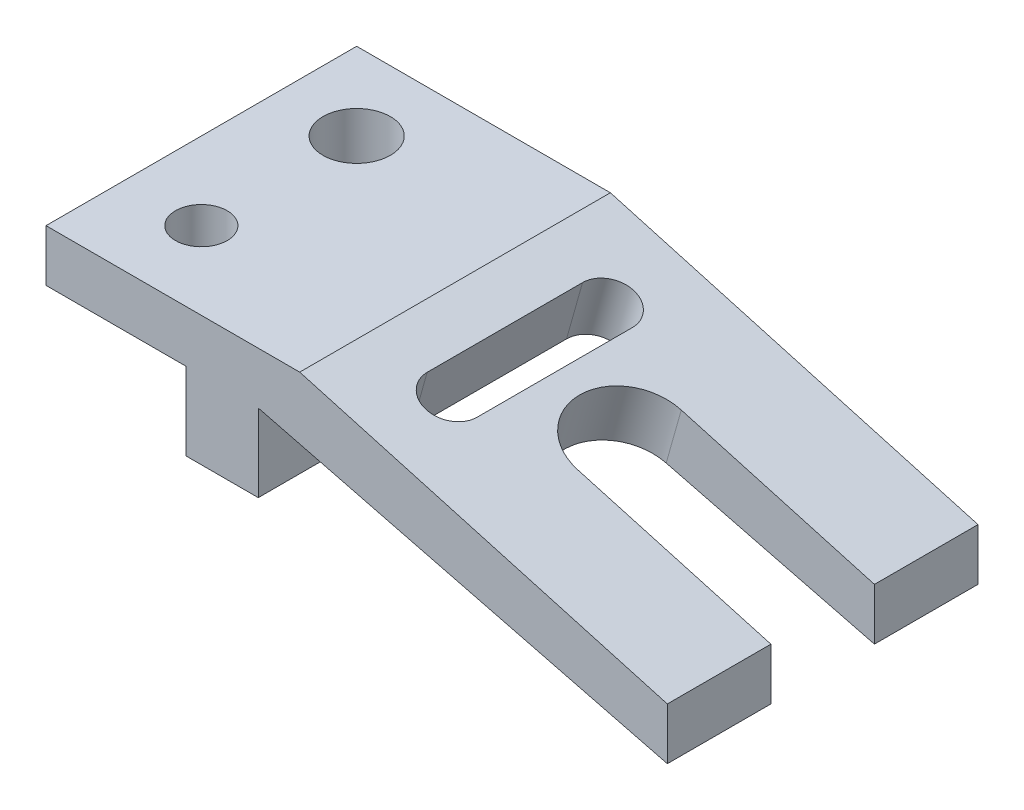
ISO-10303-21;
HEADER;
FILE_DESCRIPTION(('STEP AP214'),'2;1');
FILE_NAME('part.step','',(''),(''),'','','');
FILE_SCHEMA(('AUTOMOTIVE_DESIGN { 1 0 10303 214 1 1 1 1 }'));
ENDSEC;
DATA;
#1=APPLICATION_CONTEXT('core data for automotive mechanical design processes');
#2=APPLICATION_PROTOCOL_DEFINITION('international standard','automotive_design',2000,#1);
#3=PRODUCT_CONTEXT('',#1,'mechanical');
#4=PRODUCT('Part','Part','',(#3));
#5=PRODUCT_RELATED_PRODUCT_CATEGORY('part','',(#4));
#6=PRODUCT_DEFINITION_FORMATION('','',#4);
#7=PRODUCT_DEFINITION_CONTEXT('part definition',#1,'design');
#8=PRODUCT_DEFINITION('design','',#6,#7);
#9=PRODUCT_DEFINITION_SHAPE('','',#8);
#10=(LENGTH_UNIT() NAMED_UNIT(*) SI_UNIT(.MILLI.,.METRE.));
#11=(NAMED_UNIT(*) PLANE_ANGLE_UNIT() SI_UNIT($,.RADIAN.));
#12=(NAMED_UNIT(*) SI_UNIT($,.STERADIAN.) SOLID_ANGLE_UNIT());
#13=UNCERTAINTY_MEASURE_WITH_UNIT(LENGTH_MEASURE(1.E-05),#10,'distance_accuracy_value','');
#14=(GEOMETRIC_REPRESENTATION_CONTEXT(3) GLOBAL_UNCERTAINTY_ASSIGNED_CONTEXT((#13)) GLOBAL_UNIT_ASSIGNED_CONTEXT((#10,
#11,#12)) REPRESENTATION_CONTEXT('',''));
#15=CARTESIAN_POINT('',(0.,0.,0.));
#16=DIRECTION('',(0.,0.,1.));
#17=DIRECTION('',(1.,0.,0.));
#18=AXIS2_PLACEMENT_3D('',#15,#16,#17);
#19=CARTESIAN_POINT('',(79.343143812709,2.44230769230769,76.2));
#20=DIRECTION('',(-1.,0.,0.));
#21=DIRECTION('',(0.,0.,1.));
#22=AXIS2_PLACEMENT_3D('',#19,#20,#21);
#23=PLANE('',#22);
#24=DIRECTION('',(0.,1.,0.));
#25=VECTOR('',#24,1.);
#26=CARTESIAN_POINT('',(79.343143812709,2.44230769230769,25.4));
#27=LINE('',#26,#25);
#28=CARTESIAN_POINT('',(79.3431438127091,-35.6576923076923,25.4));
#29=VERTEX_POINT('',#28);
#30=CARTESIAN_POINT('',(79.343143812709,-22.9576923076923,25.4));
#31=VERTEX_POINT('',#30);
#32=EDGE_CURVE('E103',#29,#31,#27,.T.);
#33=ORIENTED_EDGE('',*,*,#32,.F.);
#34=DIRECTION('',(0.,0.,-1.));
#35=VECTOR('',#34,1.);
#36=CARTESIAN_POINT('',(79.343143812709,-35.6576923076923,76.2));
#37=LINE('',#36,#35);
#38=CARTESIAN_POINT('',(79.343143812709,-35.6576923076923,0.));
#39=VERTEX_POINT('',#38);
#40=EDGE_CURVE('E229',#29,#39,#37,.T.);
#41=ORIENTED_EDGE('',*,*,#40,.T.);
#42=DIRECTION('',(0.,1.,0.));
#43=VECTOR('',#42,1.);
#44=CARTESIAN_POINT('',(79.343143812709,2.44230769230769,0.));
#45=LINE('',#44,#43);
#46=CARTESIAN_POINT('',(79.343143812709,-22.9576923076923,0.));
#47=VERTEX_POINT('',#46);
#48=EDGE_CURVE('E367',#39,#47,#45,.T.);
#49=ORIENTED_EDGE('',*,*,#48,.T.);
#50=DIRECTION('',(0.,0.,1.));
#51=VECTOR('',#50,1.);
#52=CARTESIAN_POINT('',(79.343143812709,-22.9576923076923,0.));
#53=LINE('',#52,#51);
#54=EDGE_CURVE('E289',#47,#31,#53,.T.);
#55=ORIENTED_EDGE('',*,*,#54,.T.);
#56=EDGE_LOOP('',(#33,#41,#49,#55));
#57=FACE_BOUND('',#56,.T.);
#58=ADVANCED_FACE('F87',(#57),#23,.F.);
#59=CARTESIAN_POINT('',(-73.056856187291,2.44230769230769,76.2));
#60=DIRECTION('',(1.,0.,0.));
#61=DIRECTION('',(0.,0.,-1.));
#62=AXIS2_PLACEMENT_3D('',#59,#60,#61);
#63=PLANE('',#62);
#64=DIRECTION('',(0.,-1.,0.));
#65=VECTOR('',#64,1.);
#66=CARTESIAN_POINT('',(-73.056856187291,2.44230769230769,0.));
#67=LINE('',#66,#65);
#68=CARTESIAN_POINT('',(-73.056856187291,2.44230769230769,0.));
#69=VERTEX_POINT('',#68);
#70=CARTESIAN_POINT('',(-73.056856187291,-10.2576923076923,0.));
#71=VERTEX_POINT('',#70);
#72=EDGE_CURVE('E347',#69,#71,#67,.T.);
#73=ORIENTED_EDGE('',*,*,#72,.T.);
#74=DIRECTION('',(0.,0.,1.));
#75=VECTOR('',#74,1.);
#76=CARTESIAN_POINT('',(-73.056856187291,-10.2576923076923,0.));
#77=LINE('',#76,#75);
#78=CARTESIAN_POINT('',(-73.056856187291,-10.2576923076923,76.2));
#79=VERTEX_POINT('',#78);
#80=EDGE_CURVE('E343',#71,#79,#77,.T.);
#81=ORIENTED_EDGE('',*,*,#80,.T.);
#82=DIRECTION('',(0.,-1.,0.));
#83=VECTOR('',#82,1.);
#84=CARTESIAN_POINT('',(-73.056856187291,2.44230769230769,76.2));
#85=LINE('',#84,#83);
#86=CARTESIAN_POINT('',(-73.056856187291,2.44230769230769,76.2));
#87=VERTEX_POINT('',#86);
#88=EDGE_CURVE('E351',#87,#79,#85,.T.);
#89=ORIENTED_EDGE('',*,*,#88,.F.);
#90=DIRECTION('',(0.,0.,-1.));
#91=VECTOR('',#90,1.);
#92=CARTESIAN_POINT('',(-73.056856187291,2.44230769230769,76.2));
#93=LINE('',#92,#91);
#94=EDGE_CURVE('E363',#87,#69,#93,.T.);
#95=ORIENTED_EDGE('',*,*,#94,.T.);
#96=EDGE_LOOP('',(#73,#81,#89,#95));
#97=FACE_BOUND('',#96,.T.);
#98=ADVANCED_FACE('F89',(#97),#63,.F.);
#99=CARTESIAN_POINT('',(79.343143812709,-35.6576923076923,76.2));
#100=VERTEX_POINT('',#99);
#101=CARTESIAN_POINT('',(79.3431438127091,-35.6576923076923,50.8));
#102=VERTEX_POINT('',#101);
#103=EDGE_CURVE('E376',#100,#102,#37,.T.);
#104=ORIENTED_EDGE('',*,*,#103,.T.);
#105=DIRECTION('',(0.,1.,0.));
#106=VECTOR('',#105,1.);
#107=CARTESIAN_POINT('',(79.343143812709,2.44230769230769,50.8));
#108=LINE('',#107,#106);
#109=CARTESIAN_POINT('',(79.343143812709,-22.9576923076923,50.8));
#110=VERTEX_POINT('',#109);
#111=EDGE_CURVE('E219',#102,#110,#108,.T.);
#112=ORIENTED_EDGE('',*,*,#111,.T.);
#113=CARTESIAN_POINT('',(79.343143812709,-22.9576923076923,76.2));
#114=VERTEX_POINT('',#113);
#115=EDGE_CURVE('E294',#110,#114,#53,.T.);
#116=ORIENTED_EDGE('',*,*,#115,.T.);
#117=DIRECTION('',(0.,1.,0.));
#118=VECTOR('',#117,1.);
#119=CARTESIAN_POINT('',(79.343143812709,2.44230769230769,76.2));
#120=LINE('',#119,#118);
#121=EDGE_CURVE('E355',#100,#114,#120,.T.);
#122=ORIENTED_EDGE('',*,*,#121,.F.);
#123=EDGE_LOOP('',(#104,#112,#116,#122));
#124=FACE_BOUND('',#123,.T.);
#125=ADVANCED_FACE('F418',(#124),#23,.F.);
#126=CARTESIAN_POINT('',(-73.056856187291,2.44230769230769,76.2));
#127=DIRECTION('',(0.,-1.,0.));
#128=DIRECTION('',(0.,0.,-1.));
#129=AXIS2_PLACEMENT_3D('',#126,#127,#128);
#130=PLANE('',#129);
#131=CARTESIAN_POINT('',(-54.006856187291,2.44230769230769,19.05));
#132=DIRECTION('',(0.,-1.,0.));
#133=DIRECTION('',(0.,0.,-1.));
#134=AXIS2_PLACEMENT_3D('',#131,#132,#133);
#135=CIRCLE('',#134,8.255);
#136=CARTESIAN_POINT('',(-54.006856187291,2.44230769230769,27.305));
#137=VERTEX_POINT('',#136);
#138=EDGE_CURVE('E271',#137,#137,#135,.T.);
#139=ORIENTED_EDGE('',*,*,#138,.T.);
#140=EDGE_LOOP('',(#139));
#141=FACE_BOUND('',#140,.T.);
#142=CARTESIAN_POINT('',(-54.006856187291,2.44230769230769,57.15));
#143=DIRECTION('',(0.,1.,0.));
#144=DIRECTION('',(0.,0.,1.));
#145=AXIS2_PLACEMENT_3D('',#142,#143,#144);
#146=CIRCLE('',#145,6.35);
#147=CARTESIAN_POINT('',(-54.006856187291,2.44230769230769,63.5));
#148=VERTEX_POINT('',#147);
#149=EDGE_CURVE('E275',#148,#148,#146,.T.);
#150=ORIENTED_EDGE('',*,*,#149,.F.);
#151=EDGE_LOOP('',(#150));
#152=FACE_BOUND('',#151,.T.);
#153=DIRECTION('',(-1.,0.,0.));
#154=VECTOR('',#153,1.);
#155=CARTESIAN_POINT('',(-73.056856187291,2.44230769230769,76.2));
#156=LINE('',#155,#154);
#157=CARTESIAN_POINT('',(-10.826856187291,2.44230769230769,76.2));
#158=VERTEX_POINT('',#157);
#159=EDGE_CURVE('E360',#158,#87,#156,.T.);
#160=ORIENTED_EDGE('',*,*,#159,.F.);
#161=DIRECTION('',(0.,0.,1.));
#162=VECTOR('',#161,1.);
#163=CARTESIAN_POINT('',(-10.826856187291,2.44230769230769,0.));
#164=LINE('',#163,#162);
#165=CARTESIAN_POINT('',(-10.826856187291,2.44230769230769,0.));
#166=VERTEX_POINT('',#165);
#167=EDGE_CURVE('E284',#166,#158,#164,.T.);
#168=ORIENTED_EDGE('',*,*,#167,.F.);
#169=DIRECTION('',(-1.,0.,0.));
#170=VECTOR('',#169,1.);
#171=CARTESIAN_POINT('',(-73.056856187291,2.44230769230769,0.));
#172=LINE('',#171,#170);
#173=EDGE_CURVE('E356',#166,#69,#172,.T.);
#174=ORIENTED_EDGE('',*,*,#173,.T.);
#175=ORIENTED_EDGE('',*,*,#94,.F.);
#176=EDGE_LOOP('',(#160,#168,#174,#175));
#177=FACE_BOUND('',#176,.T.);
#178=ADVANCED_FACE('F487',(#141,#152,#177),#130,.F.);
#179=CARTESIAN_POINT('',(0.,0.,76.2));
#180=DIRECTION('',(0.,0.,1.));
#181=DIRECTION('',(1.,0.,0.));
#182=AXIS2_PLACEMENT_3D('',#179,#180,#181);
#183=PLANE('',#182);
#184=DIRECTION('',(0.962540441844964,-0.271138152632384,0.));
#185=VECTOR('',#184,1.);
#186=CARTESIAN_POINT('',(79.343143812709,-22.9576923076923,76.2));
#187=LINE('',#186,#185);
#188=EDGE_CURVE('E285',#158,#114,#187,.T.);
#189=ORIENTED_EDGE('',*,*,#188,.F.);
#190=ORIENTED_EDGE('',*,*,#159,.T.);
#191=ORIENTED_EDGE('',*,*,#88,.T.);
#192=DIRECTION('',(-1.,0.,0.));
#193=VECTOR('',#192,1.);
#194=CARTESIAN_POINT('',(-73.056856187291,-10.2576923076923,76.2));
#195=LINE('',#194,#193);
#196=CARTESIAN_POINT('',(-38.766856187291,-10.2576923076923,76.2));
#197=VERTEX_POINT('',#196);
#198=EDGE_CURVE('E334',#197,#79,#195,.T.);
#199=ORIENTED_EDGE('',*,*,#198,.F.);
#200=DIRECTION('',(0.,1.,0.));
#201=VECTOR('',#200,1.);
#202=CARTESIAN_POINT('',(-38.766856187291,-35.6576923076923,76.2));
#203=LINE('',#202,#201);
#204=CARTESIAN_POINT('',(-38.766856187291,-29.3076923076923,76.2));
#205=VERTEX_POINT('',#204);
#206=EDGE_CURVE('E326',#205,#197,#203,.T.);
#207=ORIENTED_EDGE('',*,*,#206,.F.);
#208=DIRECTION('',(-1.,0.,0.));
#209=VECTOR('',#208,1.);
#210=CARTESIAN_POINT('',(-38.766856187291,-29.3076923076923,76.2));
#211=LINE('',#210,#209);
#212=CARTESIAN_POINT('',(-20.986856187291,-29.3076923076923,76.2));
#213=VERTEX_POINT('',#212);
#214=EDGE_CURVE('E314',#213,#205,#211,.T.);
#215=ORIENTED_EDGE('',*,*,#214,.F.);
#216=DIRECTION('',(0.,-1.,0.));
#217=VECTOR('',#216,1.);
#218=CARTESIAN_POINT('',(-20.986856187291,-35.6576923076923,76.2));
#219=LINE('',#218,#217);
#220=CARTESIAN_POINT('',(-20.986856187291,-10.2576923076923,76.2));
#221=VERTEX_POINT('',#220);
#222=EDGE_CURVE('E302',#221,#213,#219,.T.);
#223=ORIENTED_EDGE('',*,*,#222,.F.);
#224=DIRECTION('',(-0.969416374533033,0.245421866970388,0.));
#225=VECTOR('',#224,1.);
#226=CARTESIAN_POINT('',(-20.986856187291,-10.2576923076923,76.2));
#227=LINE('',#226,#225);
#228=EDGE_CURVE('E293',#100,#221,#227,.T.);
#229=ORIENTED_EDGE('',*,*,#228,.F.);
#230=ORIENTED_EDGE('',*,*,#121,.T.);
#231=EDGE_LOOP('',(#189,#190,#191,#199,#207,#215,#223,#229,#230));
#232=FACE_BOUND('',#231,.T.);
#233=ADVANCED_FACE('F421',(#232),#183,.T.);
#234=CARTESIAN_POINT('',(0.,0.,0.));
#235=DIRECTION('',(0.,0.,1.));
#236=DIRECTION('',(1.,0.,0.));
#237=AXIS2_PLACEMENT_3D('',#234,#235,#236);
#238=PLANE('',#237);
#239=ORIENTED_EDGE('',*,*,#173,.F.);
#240=DIRECTION('',(0.962540441844964,-0.271138152632384,0.));
#241=VECTOR('',#240,1.);
#242=CARTESIAN_POINT('',(79.343143812709,-22.9576923076923,0.));
#243=LINE('',#242,#241);
#244=EDGE_CURVE('E280',#166,#47,#243,.T.);
#245=ORIENTED_EDGE('',*,*,#244,.T.);
#246=ORIENTED_EDGE('',*,*,#48,.F.);
#247=DIRECTION('',(-0.969416374533033,0.245421866970388,0.));
#248=VECTOR('',#247,1.);
#249=CARTESIAN_POINT('',(-20.986856187291,-10.2576923076923,0.));
#250=LINE('',#249,#248);
#251=CARTESIAN_POINT('',(-20.986856187291,-10.2576923076923,0.));
#252=VERTEX_POINT('',#251);
#253=EDGE_CURVE('E297',#39,#252,#250,.T.);
#254=ORIENTED_EDGE('',*,*,#253,.T.);
#255=DIRECTION('',(0.,-1.,0.));
#256=VECTOR('',#255,1.);
#257=CARTESIAN_POINT('',(-20.986856187291,-35.6576923076923,0.));
#258=LINE('',#257,#256);
#259=CARTESIAN_POINT('',(-20.986856187291,-29.3076923076923,0.));
#260=VERTEX_POINT('',#259);
#261=EDGE_CURVE('E301',#252,#260,#258,.T.);
#262=ORIENTED_EDGE('',*,*,#261,.T.);
#263=DIRECTION('',(-1.,0.,0.));
#264=VECTOR('',#263,1.);
#265=CARTESIAN_POINT('',(-38.766856187291,-29.3076923076923,0.));
#266=LINE('',#265,#264);
#267=CARTESIAN_POINT('',(-38.766856187291,-29.3076923076923,0.));
#268=VERTEX_POINT('',#267);
#269=EDGE_CURVE('E315',#260,#268,#266,.T.);
#270=ORIENTED_EDGE('',*,*,#269,.T.);
#271=DIRECTION('',(0.,1.,0.));
#272=VECTOR('',#271,1.);
#273=CARTESIAN_POINT('',(-38.766856187291,-35.6576923076923,0.));
#274=LINE('',#273,#272);
#275=CARTESIAN_POINT('',(-38.766856187291,-10.2576923076923,0.));
#276=VERTEX_POINT('',#275);
#277=EDGE_CURVE('E330',#268,#276,#274,.T.);
#278=ORIENTED_EDGE('',*,*,#277,.T.);
#279=DIRECTION('',(-1.,0.,0.));
#280=VECTOR('',#279,1.);
#281=CARTESIAN_POINT('',(-73.056856187291,-10.2576923076923,0.));
#282=LINE('',#281,#280);
#283=EDGE_CURVE('E333',#276,#71,#282,.T.);
#284=ORIENTED_EDGE('',*,*,#283,.T.);
#285=ORIENTED_EDGE('',*,*,#72,.F.);
#286=EDGE_LOOP('',(#239,#245,#246,#254,#262,#270,#278,#284,#285));
#287=FACE_BOUND('',#286,.T.);
#288=ADVANCED_FACE('F432',(#287),#238,.F.);
#289=CARTESIAN_POINT('',(-73.056856187291,-10.2576923076923,0.));
#290=DIRECTION('',(0.,1.,0.));
#291=DIRECTION('',(0.,0.,1.));
#292=AXIS2_PLACEMENT_3D('',#289,#290,#291);
#293=PLANE('',#292);
#294=CARTESIAN_POINT('',(-54.006856187291,-10.2576923076923,19.05));
#295=DIRECTION('',(0.,1.,0.));
#296=DIRECTION('',(0.,0.,1.));
#297=AXIS2_PLACEMENT_3D('',#294,#295,#296);
#298=CIRCLE('',#297,8.255);
#299=CARTESIAN_POINT('',(-54.006856187291,-10.2576923076923,27.305));
#300=VERTEX_POINT('',#299);
#301=EDGE_CURVE('E270',#300,#300,#298,.T.);
#302=ORIENTED_EDGE('',*,*,#301,.T.);
#303=EDGE_LOOP('',(#302));
#304=FACE_BOUND('',#303,.T.);
#305=CARTESIAN_POINT('',(-54.006856187291,-10.2576923076923,57.15));
#306=DIRECTION('',(0.,1.,0.));
#307=DIRECTION('',(0.,0.,1.));
#308=AXIS2_PLACEMENT_3D('',#305,#306,#307);
#309=CIRCLE('',#308,6.35);
#310=CARTESIAN_POINT('',(-54.006856187291,-10.2576923076923,63.5));
#311=VERTEX_POINT('',#310);
#312=EDGE_CURVE('E279',#311,#311,#309,.T.);
#313=ORIENTED_EDGE('',*,*,#312,.T.);
#314=EDGE_LOOP('',(#313));
#315=FACE_BOUND('',#314,.T.);
#316=ORIENTED_EDGE('',*,*,#198,.T.);
#317=ORIENTED_EDGE('',*,*,#80,.F.);
#318=ORIENTED_EDGE('',*,*,#283,.F.);
#319=DIRECTION('',(0.,0.,1.));
#320=VECTOR('',#319,1.);
#321=CARTESIAN_POINT('',(-38.766856187291,-10.2576923076923,0.));
#322=LINE('',#321,#320);
#323=EDGE_CURVE('E338',#276,#197,#322,.T.);
#324=ORIENTED_EDGE('',*,*,#323,.T.);
#325=EDGE_LOOP('',(#316,#317,#318,#324));
#326=FACE_BOUND('',#325,.T.);
#327=ADVANCED_FACE('F496',(#304,#315,#326),#293,.F.);
#328=CARTESIAN_POINT('',(-38.766856187291,-35.6576923076923,0.));
#329=DIRECTION('',(1.,0.,0.));
#330=DIRECTION('',(0.,0.,-1.));
#331=AXIS2_PLACEMENT_3D('',#328,#329,#330);
#332=PLANE('',#331);
#333=ORIENTED_EDGE('',*,*,#277,.F.);
#334=DIRECTION('',(0.,0.,1.));
#335=VECTOR('',#334,1.);
#336=CARTESIAN_POINT('',(-38.766856187291,-29.3076923076923,0.));
#337=LINE('',#336,#335);
#338=EDGE_CURVE('E322',#268,#205,#337,.T.);
#339=ORIENTED_EDGE('',*,*,#338,.T.);
#340=ORIENTED_EDGE('',*,*,#206,.T.);
#341=ORIENTED_EDGE('',*,*,#323,.F.);
#342=EDGE_LOOP('',(#333,#339,#340,#341));
#343=FACE_BOUND('',#342,.T.);
#344=ADVANCED_FACE('F500',(#343),#332,.F.);
#345=CARTESIAN_POINT('',(-38.766856187291,-29.3076923076923,0.));
#346=DIRECTION('',(0.,1.,0.));
#347=DIRECTION('',(0.,0.,1.));
#348=AXIS2_PLACEMENT_3D('',#345,#346,#347);
#349=PLANE('',#348);
#350=ORIENTED_EDGE('',*,*,#214,.T.);
#351=ORIENTED_EDGE('',*,*,#338,.F.);
#352=ORIENTED_EDGE('',*,*,#269,.F.);
#353=DIRECTION('',(0.,0.,1.));
#354=VECTOR('',#353,1.);
#355=CARTESIAN_POINT('',(-20.986856187291,-29.3076923076923,0.));
#356=LINE('',#355,#354);
#357=EDGE_CURVE('E319',#260,#213,#356,.T.);
#358=ORIENTED_EDGE('',*,*,#357,.T.);
#359=EDGE_LOOP('',(#350,#351,#352,#358));
#360=FACE_BOUND('',#359,.T.);
#361=ADVANCED_FACE('F502',(#360),#349,.F.);
#362=CARTESIAN_POINT('',(-20.986856187291,-35.6576923076923,0.));
#363=DIRECTION('',(-1.,0.,0.));
#364=DIRECTION('',(0.,-1.,0.));
#365=AXIS2_PLACEMENT_3D('',#362,#363,#364);
#366=PLANE('',#365);
#367=ORIENTED_EDGE('',*,*,#261,.F.);
#368=DIRECTION('',(0.,0.,1.));
#369=VECTOR('',#368,1.);
#370=CARTESIAN_POINT('',(-20.986856187291,-10.2576923076923,0.));
#371=LINE('',#370,#369);
#372=EDGE_CURVE('E306',#252,#221,#371,.T.);
#373=ORIENTED_EDGE('',*,*,#372,.T.);
#374=ORIENTED_EDGE('',*,*,#222,.T.);
#375=ORIENTED_EDGE('',*,*,#357,.F.);
#376=EDGE_LOOP('',(#367,#373,#374,#375));
#377=FACE_BOUND('',#376,.T.);
#378=ADVANCED_FACE('F428',(#377),#366,.F.);
#379=CARTESIAN_POINT('',(-20.986856187291,-10.2576923076923,0.));
#380=DIRECTION('',(0.245421866970388,0.969416374533033,0.));
#381=DIRECTION('',(-0.969416374533033,0.245421866970388,0.));
#382=AXIS2_PLACEMENT_3D('',#379,#380,#381);
#383=PLANE('',#382);
#384=DIRECTION('',(0.,0.,1.));
#385=VECTOR('',#384,1.);
#386=CARTESIAN_POINT('',(-2.52654785524937,-14.931188087956,0.));
#387=LINE('',#386,#385);
#388=CARTESIAN_POINT('',(-2.52654785524937,-14.931188087956,19.05));
#389=VERTEX_POINT('',#388);
#390=CARTESIAN_POINT('',(-2.52654785524937,-14.931188087956,57.15));
#391=VERTEX_POINT('',#390);
#392=EDGE_CURVE('E263',#389,#391,#387,.T.);
#393=ORIENTED_EDGE('',*,*,#392,.T.);
#394=CARTESIAN_POINT('',(3.63142791170338,-16.4901692947795,57.15));
#395=DIRECTION('',(0.245421866970388,0.969416374533033,0.));
#396=DIRECTION('',(0.969416374533033,-0.245421866970388,0.));
#397=AXIS2_PLACEMENT_3D('',#394,#395,#396);
#398=ELLIPSE('',#397,6.35225062081197,6.35);
#399=CARTESIAN_POINT('',(9.78940367865613,-18.049150501603,57.15));
#400=VERTEX_POINT('',#399);
#401=EDGE_CURVE('E259',#391,#400,#398,.T.);
#402=ORIENTED_EDGE('',*,*,#401,.T.);
#403=DIRECTION('',(0.,0.,1.));
#404=VECTOR('',#403,1.);
#405=CARTESIAN_POINT('',(9.78940367865611,-18.049150501603,0.));
#406=LINE('',#405,#404);
#407=CARTESIAN_POINT('',(9.78940367865613,-18.049150501603,19.05));
#408=VERTEX_POINT('',#407);
#409=EDGE_CURVE('E267',#408,#400,#406,.T.);
#410=ORIENTED_EDGE('',*,*,#409,.F.);
#411=CARTESIAN_POINT('',(3.63142791170338,-16.4901692947795,19.05));
#412=DIRECTION('',(0.245421866970388,0.969416374533033,0.));
#413=DIRECTION('',(0.969416374533033,-0.245421866970388,0.));
#414=AXIS2_PLACEMENT_3D('',#411,#412,#413);
#415=ELLIPSE('',#414,6.35225062081197,6.35);
#416=EDGE_CURVE('E247',#408,#389,#415,.T.);
#417=ORIENTED_EDGE('',*,*,#416,.T.);
#418=EDGE_LOOP('',(#393,#402,#410,#417));
#419=FACE_BOUND('',#418,.T.);
#420=CARTESIAN_POINT('',(28.2633309795144,-22.7260941220734,38.1));
#421=DIRECTION('',(0.245421866970388,0.969416374533033,0.));
#422=DIRECTION('',(0.969416374533033,-0.245421866970388,0.));
#423=AXIS2_PLACEMENT_3D('',#420,#421,#422);
#424=ELLIPSE('',#423,12.7045012416239,12.7);
#425=CARTESIAN_POINT('',(28.2633309795144,-22.7260941220734,25.4));
#426=VERTEX_POINT('',#425);
#427=CARTESIAN_POINT('',(28.2633309795144,-22.7260941220734,50.8));
#428=VERTEX_POINT('',#427);
#429=EDGE_CURVE('E208',#426,#428,#424,.T.);
#430=ORIENTED_EDGE('',*,*,#429,.T.);
#431=DIRECTION('',(0.969416374533033,-0.245421866970388,0.));
#432=VECTOR('',#431,1.);
#433=CARTESIAN_POINT('',(-20.986856187291,-10.2576923076923,50.8));
#434=LINE('',#433,#432);
#435=EDGE_CURVE('E239',#428,#102,#434,.T.);
#436=ORIENTED_EDGE('',*,*,#435,.T.);
#437=ORIENTED_EDGE('',*,*,#103,.F.);
#438=ORIENTED_EDGE('',*,*,#228,.T.);
#439=ORIENTED_EDGE('',*,*,#372,.F.);
#440=ORIENTED_EDGE('',*,*,#253,.F.);
#441=ORIENTED_EDGE('',*,*,#40,.F.);
#442=DIRECTION('',(0.969416374533033,-0.245421866970388,0.));
#443=VECTOR('',#442,1.);
#444=CARTESIAN_POINT('',(-20.986856187291,-10.2576923076923,25.4));
#445=LINE('',#444,#443);
#446=EDGE_CURVE('E220',#426,#29,#445,.T.);
#447=ORIENTED_EDGE('',*,*,#446,.F.);
#448=EDGE_LOOP('',(#430,#436,#437,#438,#439,#440,#441,#447));
#449=FACE_BOUND('',#448,.T.);
#450=ADVANCED_FACE('F227',(#419,#449),#383,.F.);
#451=CARTESIAN_POINT('',(79.343143812709,-22.9576923076923,0.));
#452=DIRECTION('',(-0.271138152632384,-0.962540441844964,0.));
#453=DIRECTION('',(0.962540441844964,-0.271138152632384,0.));
#454=AXIS2_PLACEMENT_3D('',#451,#452,#453);
#455=PLANE('',#454);
#456=DIRECTION('',(0.,0.,-1.));
#457=VECTOR('',#456,1.);
#458=CARTESIAN_POINT('',(13.6216710355711,-4.44460138455487,0.));
#459=LINE('',#458,#457);
#460=CARTESIAN_POINT('',(13.6216710355711,-4.44460138455486,57.15));
#461=VERTEX_POINT('',#460);
#462=CARTESIAN_POINT('',(13.6216710355711,-4.44460138455486,19.05));
#463=VERTEX_POINT('',#462);
#464=EDGE_CURVE('E394',#461,#463,#459,.T.);
#465=ORIENTED_EDGE('',*,*,#464,.F.);
#466=CARTESIAN_POINT('',(7.50953922985557,-2.72287411533922,57.15));
#467=DIRECTION('',(-0.271138152632384,-0.962540441844964,0.));
#468=DIRECTION('',(0.962540441844964,-0.271138152632384,0.));
#469=AXIS2_PLACEMENT_3D('',#466,#467,#468);
#470=CIRCLE('',#469,6.35);
#471=CARTESIAN_POINT('',(1.39740742414005,-1.00114684612358,57.15));
#472=VERTEX_POINT('',#471);
#473=EDGE_CURVE('E398',#461,#472,#470,.T.);
#474=ORIENTED_EDGE('',*,*,#473,.T.);
#475=DIRECTION('',(0.,0.,-1.));
#476=VECTOR('',#475,1.);
#477=CARTESIAN_POINT('',(1.39740742414006,-1.00114684612359,0.));
#478=LINE('',#477,#476);
#479=CARTESIAN_POINT('',(1.39740742414005,-1.00114684612358,19.05));
#480=VERTEX_POINT('',#479);
#481=EDGE_CURVE('E390',#472,#480,#478,.T.);
#482=ORIENTED_EDGE('',*,*,#481,.T.);
#483=CARTESIAN_POINT('',(7.50953922985557,-2.72287411533922,19.05));
#484=DIRECTION('',(-0.271138152632384,-0.962540441844964,0.));
#485=DIRECTION('',(0.962540441844964,-0.271138152632384,0.));
#486=AXIS2_PLACEMENT_3D('',#483,#484,#485);
#487=CIRCLE('',#486,6.35);
#488=EDGE_CURVE('E380',#480,#463,#487,.T.);
#489=ORIENTED_EDGE('',*,*,#488,.T.);
#490=EDGE_LOOP('',(#465,#474,#482,#489));
#491=FACE_BOUND('',#490,.T.);
#492=ORIENTED_EDGE('',*,*,#115,.F.);
#493=DIRECTION('',(-0.962540441844964,0.271138152632384,0.));
#494=VECTOR('',#493,1.);
#495=CARTESIAN_POINT('',(79.343143812709,-22.9576923076923,50.8));
#496=LINE('',#495,#494);
#497=CARTESIAN_POINT('',(31.9580664527176,-9.60978319220179,50.8));
#498=VERTEX_POINT('',#497);
#499=EDGE_CURVE('E12',#110,#498,#496,.T.);
#500=ORIENTED_EDGE('',*,*,#499,.T.);
#501=CARTESIAN_POINT('',(31.9580664527176,-9.60978319220179,38.1));
#502=DIRECTION('',(-0.271138152632384,-0.962540441844964,0.));
#503=DIRECTION('',(0.962540441844964,-0.271138152632384,0.));
#504=AXIS2_PLACEMENT_3D('',#501,#502,#503);
#505=CIRCLE('',#504,12.7);
#506=CARTESIAN_POINT('',(31.9580664527176,-9.60978319220179,25.4));
#507=VERTEX_POINT('',#506);
#508=EDGE_CURVE('E96',#498,#507,#505,.T.);
#509=ORIENTED_EDGE('',*,*,#508,.T.);
#510=DIRECTION('',(-0.962540441844964,0.271138152632384,0.));
#511=VECTOR('',#510,1.);
#512=CARTESIAN_POINT('',(79.343143812709,-22.9576923076923,25.4));
#513=LINE('',#512,#511);
#514=EDGE_CURVE('E223',#31,#507,#513,.T.);
#515=ORIENTED_EDGE('',*,*,#514,.F.);
#516=ORIENTED_EDGE('',*,*,#54,.F.);
#517=ORIENTED_EDGE('',*,*,#244,.F.);
#518=ORIENTED_EDGE('',*,*,#167,.T.);
#519=ORIENTED_EDGE('',*,*,#188,.T.);
#520=EDGE_LOOP('',(#492,#500,#509,#515,#516,#517,#518,#519));
#521=FACE_BOUND('',#520,.T.);
#522=ADVANCED_FACE('F407',(#491,#521),#455,.F.);
#523=CARTESIAN_POINT('',(-54.006856187291,-35.6576923076923,57.15));
#524=DIRECTION('',(0.,1.,0.));
#525=DIRECTION('',(0.,0.,1.));
#526=AXIS2_PLACEMENT_3D('',#523,#524,#525);
#527=CYLINDRICAL_SURFACE('',#526,6.35);
#528=ORIENTED_EDGE('',*,*,#149,.T.);
#529=EDGE_LOOP('',(#528));
#530=FACE_BOUND('',#529,.T.);
#531=ORIENTED_EDGE('',*,*,#312,.F.);
#532=EDGE_LOOP('',(#531));
#533=FACE_BOUND('',#532,.T.);
#534=ADVANCED_FACE('F538',(#530,#533),#527,.F.);
#535=CARTESIAN_POINT('',(-54.006856187291,-35.6576923076923,19.05));
#536=DIRECTION('',(0.,1.,0.));
#537=DIRECTION('',(0.,0.,1.));
#538=AXIS2_PLACEMENT_3D('',#535,#536,#537);
#539=CYLINDRICAL_SURFACE('',#538,8.255);
#540=CARTESIAN_POINT('',(-54.006856187291,-10.2576923076923,27.305));
#541=CARTESIAN_POINT('',(-54.006856187291,-10.1254006410257,27.305));
#542=CARTESIAN_POINT('',(-54.006856187291,-9.99310897435898,27.305));
#543=CARTESIAN_POINT('',(-54.006856187291,-9.72852564102565,27.305));
#544=CARTESIAN_POINT('',(-54.006856187291,-9.59623397435898,27.305));
#545=CARTESIAN_POINT('',(-54.006856187291,-9.33165064102565,27.305));
#546=CARTESIAN_POINT('',(-54.006856187291,-9.19935897435898,27.305));
#547=CARTESIAN_POINT('',(-54.006856187291,-8.93477564102565,27.305));
#548=CARTESIAN_POINT('',(-54.006856187291,-8.80248397435898,27.305));
#549=CARTESIAN_POINT('',(-54.006856187291,-8.53790064102565,27.305));
#550=CARTESIAN_POINT('',(-54.006856187291,-8.40560897435898,27.305));
#551=CARTESIAN_POINT('',(-54.006856187291,-8.14102564102565,27.305));
#552=CARTESIAN_POINT('',(-54.006856187291,-8.00873397435898,27.305));
#553=CARTESIAN_POINT('',(-54.006856187291,-7.74415064102565,27.305));
#554=CARTESIAN_POINT('',(-54.006856187291,-7.61185897435898,27.305));
#555=CARTESIAN_POINT('',(-54.006856187291,-7.34727564102565,27.305));
#556=CARTESIAN_POINT('',(-54.006856187291,-7.21498397435898,27.305));
#557=CARTESIAN_POINT('',(-54.006856187291,-6.95040064102565,27.305));
#558=CARTESIAN_POINT('',(-54.006856187291,-6.81810897435898,27.305));
#559=CARTESIAN_POINT('',(-54.006856187291,-6.55352564102565,27.305));
#560=CARTESIAN_POINT('',(-54.006856187291,-6.42123397435898,27.305));
#561=CARTESIAN_POINT('',(-54.006856187291,-6.15665064102565,27.305));
#562=CARTESIAN_POINT('',(-54.006856187291,-6.02435897435898,27.305));
#563=CARTESIAN_POINT('',(-54.006856187291,-5.75977564102565,27.305));
#564=CARTESIAN_POINT('',(-54.006856187291,-5.62748397435898,27.305));
#565=CARTESIAN_POINT('',(-54.006856187291,-5.36290064102565,27.305));
#566=CARTESIAN_POINT('',(-54.006856187291,-5.23060897435898,27.305));
#567=CARTESIAN_POINT('',(-54.006856187291,-4.96602564102565,27.305));
#568=CARTESIAN_POINT('',(-54.006856187291,-4.83373397435898,27.305));
#569=CARTESIAN_POINT('',(-54.006856187291,-4.56915064102565,27.305));
#570=CARTESIAN_POINT('',(-54.006856187291,-4.43685897435898,27.305));
#571=CARTESIAN_POINT('',(-54.006856187291,-4.17227564102565,27.305));
#572=CARTESIAN_POINT('',(-54.006856187291,-4.03998397435899,27.305));
#573=CARTESIAN_POINT('',(-54.006856187291,-3.77540064102565,27.305));
#574=CARTESIAN_POINT('',(-54.006856187291,-3.64310897435898,27.305));
#575=CARTESIAN_POINT('',(-54.006856187291,-3.37852564102565,27.305));
#576=CARTESIAN_POINT('',(-54.006856187291,-3.24623397435898,27.305));
#577=CARTESIAN_POINT('',(-54.006856187291,-2.98165064102565,27.305));
#578=CARTESIAN_POINT('',(-54.006856187291,-2.84935897435899,27.305));
#579=CARTESIAN_POINT('',(-54.006856187291,-2.58477564102565,27.305));
#580=CARTESIAN_POINT('',(-54.006856187291,-2.45248397435898,27.305));
#581=CARTESIAN_POINT('',(-54.006856187291,-2.18790064102565,27.305));
#582=CARTESIAN_POINT('',(-54.006856187291,-2.05560897435898,27.305));
#583=CARTESIAN_POINT('',(-54.006856187291,-1.79102564102565,27.305));
#584=CARTESIAN_POINT('',(-54.006856187291,-1.65873397435898,27.305));
#585=CARTESIAN_POINT('',(-54.006856187291,-1.39415064102565,27.305));
#586=CARTESIAN_POINT('',(-54.006856187291,-1.26185897435898,27.305));
#587=CARTESIAN_POINT('',(-54.006856187291,-0.997275641025648,27.305));
#588=CARTESIAN_POINT('',(-54.006856187291,-0.864983974358982,27.305));
#589=CARTESIAN_POINT('',(-54.006856187291,-0.60040064102565,27.305));
#590=CARTESIAN_POINT('',(-54.006856187291,-0.468108974358984,27.305));
#591=CARTESIAN_POINT('',(-54.006856187291,-0.20352564102565,27.305));
#592=CARTESIAN_POINT('',(-54.006856187291,-0.0712339743589816,27.305));
#593=CARTESIAN_POINT('',(-54.006856187291,0.193349358974353,27.305));
#594=CARTESIAN_POINT('',(-54.006856187291,0.325641025641019,27.305));
#595=CARTESIAN_POINT('',(-54.006856187291,0.590224358974351,27.305));
#596=CARTESIAN_POINT('',(-54.006856187291,0.722516025641017,27.305));
#597=CARTESIAN_POINT('',(-54.006856187291,0.987099358974351,27.305));
#598=CARTESIAN_POINT('',(-54.006856187291,1.11939102564102,27.305));
#599=CARTESIAN_POINT('',(-54.006856187291,1.38397435897435,27.305));
#600=CARTESIAN_POINT('',(-54.006856187291,1.51626602564102,27.305));
#601=CARTESIAN_POINT('',(-54.006856187291,1.78084935897435,27.305));
#602=CARTESIAN_POINT('',(-54.006856187291,1.91314102564102,27.305));
#603=CARTESIAN_POINT('',(-54.006856187291,2.17772435897436,27.305));
#604=CARTESIAN_POINT('',(-54.006856187291,2.31001602564102,27.305));
#605=CARTESIAN_POINT('',(-54.006856187291,2.44230769230769,27.305));
#606=B_SPLINE_CURVE_WITH_KNOTS('',3,(#540,#541,#542,#543,#544,#545,#546,#547,#548,#549,#550,
#551,#552,#553,#554,#555,#556,#557,#558,#559,#560,#561,#562,#563,#564,#565,#566,#567,#568,#569,
#570,#571,#572,#573,#574,#575,#576,#577,#578,#579,#580,#581,#582,#583,#584,#585,#586,#587,#588,
#589,#590,#591,#592,#593,#594,#595,#596,#597,#598,#599,#600,#601,#602,#603,#604,#605),
.UNSPECIFIED.,.F.,.F.,(4,2,2,2,2,2,2,2,2,2,2,2,2,2,2,2,2,2,2,2,2,2,2,2,2,2,2,2,2,2,2,2,4),(0.,
0.396875000000001,0.793749999999999,1.190625,1.5875,1.984375,2.38125,2.778125,3.175,3.571875,
3.96875,4.365625,4.7625,5.159375,5.55625000000001,5.953125,6.35,6.746875,7.14375,7.540625,
7.9375,8.334375,8.73125,9.128125,9.525,9.921875,10.31875,10.715625,11.1125,11.509375,11.90625,
12.303125,12.7),.UNSPECIFIED.);
#607=EDGE_CURVE('BSEAM540',#300,#137,#606,.T.);
#608=ORIENTED_EDGE('',*,*,#301,.F.);
#609=ORIENTED_EDGE('',*,*,#138,.F.);
#610=ORIENTED_EDGE('',*,*,#607,.T.);
#611=ORIENTED_EDGE('',*,*,#607,.F.);
#612=EDGE_LOOP('',(#608,#610,#609,#611));
#613=FACE_BOUND('',#612,.T.);
#614=ADVANCED_FACE('F540',(#613),#539,.F.);
#615=CARTESIAN_POINT('',(-0.89661604400988,-55.9845205170673,0.));
#616=DIRECTION('',(-0.962540441844964,0.271138152632384,0.));
#617=DIRECTION('',(-0.271138152632384,-0.962540441844964,0.));
#618=AXIS2_PLACEMENT_3D('',#615,#616,#617);
#619=PLANE('',#618);
#620=ORIENTED_EDGE('',*,*,#409,.T.);
#621=DIRECTION('',(0.271138152632384,0.962540441844964,0.));
#622=VECTOR('',#621,1.);
#623=CARTESIAN_POINT('',(-0.896616044009871,-55.9845205170673,57.15));
#624=LINE('',#623,#622);
#625=EDGE_CURVE('E243',#400,#461,#624,.T.);
#626=ORIENTED_EDGE('',*,*,#625,.T.);
#627=ORIENTED_EDGE('',*,*,#464,.T.);
#628=DIRECTION('',(0.271138152632384,0.962540441844964,0.));
#629=VECTOR('',#628,1.);
#630=CARTESIAN_POINT('',(-0.896616044009877,-55.9845205170673,19.05));
#631=LINE('',#630,#629);
#632=EDGE_CURVE('E242',#408,#463,#631,.T.);
#633=ORIENTED_EDGE('',*,*,#632,.F.);
#634=EDGE_LOOP('',(#620,#626,#627,#633));
#635=FACE_BOUND('',#634,.T.);
#636=ADVANCED_FACE('F547',(#635),#619,.T.);
#637=CARTESIAN_POINT('',(-13.1208796554409,-52.541065978636,0.));
#638=DIRECTION('',(-0.962540441844964,0.271138152632384,0.));
#639=DIRECTION('',(-0.271138152632384,-0.962540441844964,0.));
#640=AXIS2_PLACEMENT_3D('',#637,#638,#639);
#641=PLANE('',#640);
#642=DIRECTION('',(0.271138152632384,0.962540441844964,0.));
#643=VECTOR('',#642,1.);
#644=CARTESIAN_POINT('',(-13.1208796554409,-52.541065978636,19.05));
#645=LINE('',#644,#643);
#646=EDGE_CURVE('E111',#389,#480,#645,.T.);
#647=ORIENTED_EDGE('',*,*,#646,.T.);
#648=ORIENTED_EDGE('',*,*,#481,.F.);
#649=DIRECTION('',(0.271138152632384,0.962540441844964,0.));
#650=VECTOR('',#649,1.);
#651=CARTESIAN_POINT('',(-13.1208796554409,-52.541065978636,57.15));
#652=LINE('',#651,#650);
#653=EDGE_CURVE('E248',#391,#472,#652,.T.);
#654=ORIENTED_EDGE('',*,*,#653,.F.);
#655=ORIENTED_EDGE('',*,*,#392,.F.);
#656=EDGE_LOOP('',(#647,#648,#654,#655));
#657=FACE_BOUND('',#656,.T.);
#658=ADVANCED_FACE('F560',(#657),#641,.F.);
#659=CARTESIAN_POINT('',(-7.00874784972539,-54.2627932478516,57.15));
#660=DIRECTION('',(0.271138152632384,0.962540441844964,0.));
#661=DIRECTION('',(-0.962540441844964,0.271138152632384,0.));
#662=AXIS2_PLACEMENT_3D('',#659,#660,#661);
#663=CYLINDRICAL_SURFACE('',#662,6.35);
#664=ORIENTED_EDGE('',*,*,#653,.T.);
#665=ORIENTED_EDGE('',*,*,#473,.F.);
#666=ORIENTED_EDGE('',*,*,#625,.F.);
#667=ORIENTED_EDGE('',*,*,#401,.F.);
#668=EDGE_LOOP('',(#664,#665,#666,#667));
#669=FACE_BOUND('',#668,.T.);
#670=ADVANCED_FACE('F562',(#669),#663,.F.);
#671=CARTESIAN_POINT('',(-7.00874784972539,-54.2627932478516,19.05));
#672=DIRECTION('',(0.271138152632384,0.962540441844964,0.));
#673=DIRECTION('',(-0.962540441844964,0.271138152632384,0.));
#674=AXIS2_PLACEMENT_3D('',#671,#672,#673);
#675=CYLINDRICAL_SURFACE('',#674,6.35);
#676=ORIENTED_EDGE('',*,*,#632,.T.);
#677=ORIENTED_EDGE('',*,*,#488,.F.);
#678=ORIENTED_EDGE('',*,*,#646,.F.);
#679=ORIENTED_EDGE('',*,*,#416,.F.);
#680=EDGE_LOOP('',(#676,#677,#678,#679));
#681=FACE_BOUND('',#680,.T.);
#682=ADVANCED_FACE('F567',(#681),#675,.F.);
#683=CARTESIAN_POINT('',(-14.6768361609703,-52.1027683714446,50.8));
#684=DIRECTION('',(0.,0.,1.));
#685=DIRECTION('',(1.,0.,0.));
#686=AXIS2_PLACEMENT_3D('',#683,#684,#685);
#687=PLANE('',#686);
#688=DIRECTION('',(0.271138152632384,0.962540441844964,0.));
#689=VECTOR('',#688,1.);
#690=CARTESIAN_POINT('',(17.4397793731367,-61.1497023247142,50.8));
#691=LINE('',#690,#689);
#692=EDGE_CURVE('E214',#428,#498,#691,.T.);
#693=ORIENTED_EDGE('',*,*,#692,.T.);
#694=ORIENTED_EDGE('',*,*,#499,.F.);
#695=ORIENTED_EDGE('',*,*,#111,.F.);
#696=ORIENTED_EDGE('',*,*,#435,.F.);
#697=EDGE_LOOP('',(#693,#694,#695,#696));
#698=FACE_BOUND('',#697,.T.);
#699=ADVANCED_FACE('F409',(#698),#687,.F.);
#700=CARTESIAN_POINT('',(17.4397793731367,-61.1497023247142,38.1));
#701=DIRECTION('',(0.271138152632384,0.962540441844964,0.));
#702=DIRECTION('',(-0.962540441844964,0.271138152632384,0.));
#703=AXIS2_PLACEMENT_3D('',#700,#701,#702);
#704=CYLINDRICAL_SURFACE('',#703,12.7);
#705=DIRECTION('',(0.271138152632384,0.962540441844964,0.));
#706=VECTOR('',#705,1.);
#707=CARTESIAN_POINT('',(17.4397793731367,-61.1497023247142,25.4));
#708=LINE('',#707,#706);
#709=EDGE_CURVE('E211',#426,#507,#708,.T.);
#710=ORIENTED_EDGE('',*,*,#709,.T.);
#711=ORIENTED_EDGE('',*,*,#508,.F.);
#712=ORIENTED_EDGE('',*,*,#692,.F.);
#713=ORIENTED_EDGE('',*,*,#429,.F.);
#714=EDGE_LOOP('',(#710,#711,#712,#713));
#715=FACE_BOUND('',#714,.T.);
#716=ADVANCED_FACE('F210',(#715),#704,.F.);
#717=CARTESIAN_POINT('',(-14.6768361609703,-52.1027683714446,25.4));
#718=DIRECTION('',(0.,0.,1.));
#719=DIRECTION('',(1.,0.,0.));
#720=AXIS2_PLACEMENT_3D('',#717,#718,#719);
#721=PLANE('',#720);
#722=ORIENTED_EDGE('',*,*,#446,.T.);
#723=ORIENTED_EDGE('',*,*,#32,.T.);
#724=ORIENTED_EDGE('',*,*,#514,.T.);
#725=ORIENTED_EDGE('',*,*,#709,.F.);
#726=EDGE_LOOP('',(#722,#723,#724,#725));
#727=FACE_BOUND('',#726,.T.);
#728=ADVANCED_FACE('F222',(#727),#721,.T.);
#729=CLOSED_SHELL('',(#58,#98,#125,#178,#233,#288,#327,#344,#361,#378,#450,#522,#534,#614,#636,
#658,#670,#682,#699,#716,#728));
#730=MANIFOLD_SOLID_BREP('B2',#729);
#731=ADVANCED_BREP_SHAPE_REPRESENTATION('',(#18,#730),#14);
#732=SHAPE_DEFINITION_REPRESENTATION(#9,#731);
ENDSEC;
END-ISO-10303-21;
